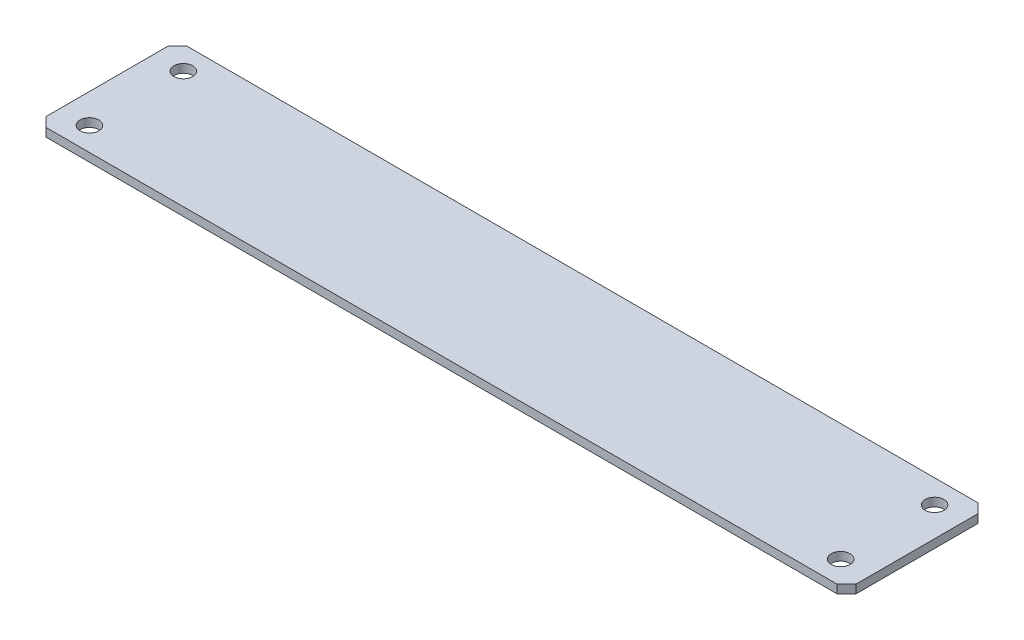
ISO-10303-21;
HEADER;
FILE_DESCRIPTION(('STEP AP214'),'2;1');
FILE_NAME('part.step','',(''),(''),'','','');
FILE_SCHEMA(('AUTOMOTIVE_DESIGN { 1 0 10303 214 1 1 1 1 }'));
ENDSEC;
DATA;
#1=APPLICATION_CONTEXT('core data for automotive mechanical design processes');
#2=APPLICATION_PROTOCOL_DEFINITION('international standard','automotive_design',2000,#1);
#3=PRODUCT_CONTEXT('',#1,'mechanical');
#4=PRODUCT('Part','Part','',(#3));
#5=PRODUCT_RELATED_PRODUCT_CATEGORY('part','',(#4));
#6=PRODUCT_DEFINITION_FORMATION('','',#4);
#7=PRODUCT_DEFINITION_CONTEXT('part definition',#1,'design');
#8=PRODUCT_DEFINITION('design','',#6,#7);
#9=PRODUCT_DEFINITION_SHAPE('','',#8);
#10=(LENGTH_UNIT() NAMED_UNIT(*) SI_UNIT(.MILLI.,.METRE.));
#11=(NAMED_UNIT(*) PLANE_ANGLE_UNIT() SI_UNIT($,.RADIAN.));
#12=(NAMED_UNIT(*) SI_UNIT($,.STERADIAN.) SOLID_ANGLE_UNIT());
#13=UNCERTAINTY_MEASURE_WITH_UNIT(LENGTH_MEASURE(1.E-05),#10,'distance_accuracy_value','');
#14=(GEOMETRIC_REPRESENTATION_CONTEXT(3) GLOBAL_UNCERTAINTY_ASSIGNED_CONTEXT((#13)) GLOBAL_UNIT_ASSIGNED_CONTEXT((#10,
#11,#12)) REPRESENTATION_CONTEXT('',''));
#15=CARTESIAN_POINT('',(0.,0.,0.));
#16=DIRECTION('',(0.,0.,1.));
#17=DIRECTION('',(1.,0.,0.));
#18=AXIS2_PLACEMENT_3D('',#15,#16,#17);
#19=CARTESIAN_POINT('',(0.,0.,0.));
#20=DIRECTION('',(0.,-1.,0.));
#21=DIRECTION('',(0.,0.,-1.));
#22=AXIS2_PLACEMENT_3D('',#19,#20,#21);
#23=PLANE('',#22);
#24=DIRECTION('',(-1.,0.,0.));
#25=VECTOR('',#24,1.);
#26=CARTESIAN_POINT('',(-109.5375,0.,19.05));
#27=LINE('',#26,#25);
#28=CARTESIAN_POINT('',(106.9975,0.,19.05));
#29=VERTEX_POINT('',#28);
#30=CARTESIAN_POINT('',(-106.9975,0.,19.05));
#31=VERTEX_POINT('',#30);
#32=EDGE_CURVE('E294',#29,#31,#27,.T.);
#33=ORIENTED_EDGE('',*,*,#32,.T.);
#34=DIRECTION('',(-0.707106781186548,0.,-0.707106781186548));
#35=VECTOR('',#34,1.);
#36=CARTESIAN_POINT('',(-106.9975,0.,19.05));
#37=LINE('',#36,#35);
#38=CARTESIAN_POINT('',(-109.5375,0.,16.51));
#39=VERTEX_POINT('',#38);
#40=EDGE_CURVE('E302',#31,#39,#37,.T.);
#41=ORIENTED_EDGE('',*,*,#40,.T.);
#42=DIRECTION('',(0.,0.,-1.));
#43=VECTOR('',#42,1.);
#44=CARTESIAN_POINT('',(-109.5375,0.,19.05));
#45=LINE('',#44,#43);
#46=CARTESIAN_POINT('',(-109.5375,0.,-16.51));
#47=VERTEX_POINT('',#46);
#48=EDGE_CURVE('E307',#39,#47,#45,.T.);
#49=ORIENTED_EDGE('',*,*,#48,.T.);
#50=DIRECTION('',(0.707106781186548,0.,-0.707106781186548));
#51=VECTOR('',#50,1.);
#52=CARTESIAN_POINT('',(-109.5375,0.,-16.51));
#53=LINE('',#52,#51);
#54=CARTESIAN_POINT('',(-106.9975,0.,-19.05));
#55=VERTEX_POINT('',#54);
#56=EDGE_CURVE('E312',#47,#55,#53,.T.);
#57=ORIENTED_EDGE('',*,*,#56,.T.);
#58=DIRECTION('',(1.,0.,0.));
#59=VECTOR('',#58,1.);
#60=CARTESIAN_POINT('',(-109.5375,0.,-19.05));
#61=LINE('',#60,#59);
#62=CARTESIAN_POINT('',(106.9975,0.,-19.05));
#63=VERTEX_POINT('',#62);
#64=EDGE_CURVE('E81',#55,#63,#61,.T.);
#65=ORIENTED_EDGE('',*,*,#64,.T.);
#66=DIRECTION('',(0.707106781186548,0.,0.707106781186548));
#67=VECTOR('',#66,1.);
#68=CARTESIAN_POINT('',(106.9975,0.,-19.05));
#69=LINE('',#68,#67);
#70=CARTESIAN_POINT('',(109.5375,0.,-16.51));
#71=VERTEX_POINT('',#70);
#72=EDGE_CURVE('E79',#63,#71,#69,.T.);
#73=ORIENTED_EDGE('',*,*,#72,.T.);
#74=DIRECTION('',(0.,0.,1.));
#75=VECTOR('',#74,1.);
#76=CARTESIAN_POINT('',(109.5375,0.,19.05));
#77=LINE('',#76,#75);
#78=CARTESIAN_POINT('',(109.5375,0.,16.51));
#79=VERTEX_POINT('',#78);
#80=EDGE_CURVE('E76',#71,#79,#77,.T.);
#81=ORIENTED_EDGE('',*,*,#80,.T.);
#82=DIRECTION('',(-0.707106781186548,0.,0.707106781186548));
#83=VECTOR('',#82,1.);
#84=CARTESIAN_POINT('',(109.5375,0.,16.51));
#85=LINE('',#84,#83);
#86=EDGE_CURVE('E288',#79,#29,#85,.T.);
#87=ORIENTED_EDGE('',*,*,#86,.T.);
#88=EDGE_LOOP('',(#33,#41,#49,#57,#65,#73,#81,#87));
#89=FACE_BOUND('',#88,.T.);
#90=CARTESIAN_POINT('',(-101.6,0.,-12.7));
#91=DIRECTION('',(0.,1.,0.));
#92=DIRECTION('',(0.,0.,1.));
#93=AXIS2_PLACEMENT_3D('',#90,#91,#92);
#94=CIRCLE('',#93,2.54);
#95=CARTESIAN_POINT('',(-101.6,0.,-10.16));
#96=VERTEX_POINT('',#95);
#97=EDGE_CURVE('E87',#96,#96,#94,.T.);
#98=ORIENTED_EDGE('',*,*,#97,.T.);
#99=EDGE_LOOP('',(#98));
#100=FACE_BOUND('',#99,.T.);
#101=CARTESIAN_POINT('',(101.6,0.,-12.7));
#102=DIRECTION('',(0.,1.,0.));
#103=DIRECTION('',(0.,0.,1.));
#104=AXIS2_PLACEMENT_3D('',#101,#102,#103);
#105=CIRCLE('',#104,2.54);
#106=CARTESIAN_POINT('',(101.6,0.,-10.16));
#107=VERTEX_POINT('',#106);
#108=EDGE_CURVE('E116',#107,#107,#105,.T.);
#109=ORIENTED_EDGE('',*,*,#108,.T.);
#110=EDGE_LOOP('',(#109));
#111=FACE_BOUND('',#110,.T.);
#112=CARTESIAN_POINT('',(101.6,0.,12.7));
#113=DIRECTION('',(0.,1.,0.));
#114=DIRECTION('',(0.,0.,1.));
#115=AXIS2_PLACEMENT_3D('',#112,#113,#114);
#116=CIRCLE('',#115,2.54);
#117=CARTESIAN_POINT('',(101.6,0.,15.24));
#118=VERTEX_POINT('',#117);
#119=EDGE_CURVE('E118',#118,#118,#116,.T.);
#120=ORIENTED_EDGE('',*,*,#119,.T.);
#121=EDGE_LOOP('',(#120));
#122=FACE_BOUND('',#121,.T.);
#123=CARTESIAN_POINT('',(-101.6,0.,12.7));
#124=DIRECTION('',(0.,1.,0.));
#125=DIRECTION('',(0.,0.,1.));
#126=AXIS2_PLACEMENT_3D('',#123,#124,#125);
#127=CIRCLE('',#126,2.54);
#128=CARTESIAN_POINT('',(-101.6,0.,15.24));
#129=VERTEX_POINT('',#128);
#130=EDGE_CURVE('E17',#129,#129,#127,.T.);
#131=ORIENTED_EDGE('',*,*,#130,.T.);
#132=EDGE_LOOP('',(#131));
#133=FACE_BOUND('',#132,.T.);
#134=ADVANCED_FACE('F14',(#89,#100,#111,#122,#133),#23,.T.);
#135=CARTESIAN_POINT('',(-101.6,0.,12.7));
#136=DIRECTION('',(0.,1.,0.));
#137=DIRECTION('',(0.,0.,1.));
#138=AXIS2_PLACEMENT_3D('',#135,#136,#137);
#139=CYLINDRICAL_SURFACE('',#138,2.54);
#140=ORIENTED_EDGE('',*,*,#130,.F.);
#141=EDGE_LOOP('',(#140));
#142=FACE_BOUND('',#141,.T.);
#143=CARTESIAN_POINT('',(-101.6,2.286,12.7));
#144=DIRECTION('',(0.,1.,0.));
#145=DIRECTION('',(0.,0.,1.));
#146=AXIS2_PLACEMENT_3D('',#143,#144,#145);
#147=CIRCLE('',#146,2.54);
#148=CARTESIAN_POINT('',(-101.6,2.286,15.24));
#149=VERTEX_POINT('',#148);
#150=EDGE_CURVE('E111',#149,#149,#147,.T.);
#151=ORIENTED_EDGE('',*,*,#150,.T.);
#152=EDGE_LOOP('',(#151));
#153=FACE_BOUND('',#152,.T.);
#154=ADVANCED_FACE('F126',(#142,#153),#139,.F.);
#155=CARTESIAN_POINT('',(101.6,0.,12.7));
#156=DIRECTION('',(0.,1.,0.));
#157=DIRECTION('',(0.,0.,1.));
#158=AXIS2_PLACEMENT_3D('',#155,#156,#157);
#159=CYLINDRICAL_SURFACE('',#158,2.54);
#160=ORIENTED_EDGE('',*,*,#119,.F.);
#161=EDGE_LOOP('',(#160));
#162=FACE_BOUND('',#161,.T.);
#163=CARTESIAN_POINT('',(101.6,2.286,12.7));
#164=DIRECTION('',(0.,1.,0.));
#165=DIRECTION('',(0.,0.,1.));
#166=AXIS2_PLACEMENT_3D('',#163,#164,#165);
#167=CIRCLE('',#166,2.54);
#168=CARTESIAN_POINT('',(101.6,2.286,15.24));
#169=VERTEX_POINT('',#168);
#170=EDGE_CURVE('E108',#169,#169,#167,.T.);
#171=ORIENTED_EDGE('',*,*,#170,.T.);
#172=EDGE_LOOP('',(#171));
#173=FACE_BOUND('',#172,.T.);
#174=ADVANCED_FACE('F129',(#162,#173),#159,.F.);
#175=CARTESIAN_POINT('',(101.6,0.,-12.7));
#176=DIRECTION('',(0.,1.,0.));
#177=DIRECTION('',(0.,0.,1.));
#178=AXIS2_PLACEMENT_3D('',#175,#176,#177);
#179=CYLINDRICAL_SURFACE('',#178,2.54);
#180=ORIENTED_EDGE('',*,*,#108,.F.);
#181=EDGE_LOOP('',(#180));
#182=FACE_BOUND('',#181,.T.);
#183=CARTESIAN_POINT('',(101.6,2.286,-12.7));
#184=DIRECTION('',(0.,1.,0.));
#185=DIRECTION('',(0.,0.,1.));
#186=AXIS2_PLACEMENT_3D('',#183,#184,#185);
#187=CIRCLE('',#186,2.54);
#188=CARTESIAN_POINT('',(101.6,2.286,-10.16));
#189=VERTEX_POINT('',#188);
#190=EDGE_CURVE('E105',#189,#189,#187,.T.);
#191=ORIENTED_EDGE('',*,*,#190,.T.);
#192=EDGE_LOOP('',(#191));
#193=FACE_BOUND('',#192,.T.);
#194=ADVANCED_FACE('F172',(#182,#193),#179,.F.);
#195=CARTESIAN_POINT('',(-101.6,0.,-12.7));
#196=DIRECTION('',(0.,1.,0.));
#197=DIRECTION('',(0.,0.,1.));
#198=AXIS2_PLACEMENT_3D('',#195,#196,#197);
#199=CYLINDRICAL_SURFACE('',#198,2.54);
#200=ORIENTED_EDGE('',*,*,#97,.F.);
#201=EDGE_LOOP('',(#200));
#202=FACE_BOUND('',#201,.T.);
#203=CARTESIAN_POINT('',(-101.6,2.286,-12.7));
#204=DIRECTION('',(0.,1.,0.));
#205=DIRECTION('',(0.,0.,1.));
#206=AXIS2_PLACEMENT_3D('',#203,#204,#205);
#207=CIRCLE('',#206,2.54);
#208=CARTESIAN_POINT('',(-101.6,2.286,-10.16));
#209=VERTEX_POINT('',#208);
#210=EDGE_CURVE('E102',#209,#209,#207,.T.);
#211=ORIENTED_EDGE('',*,*,#210,.T.);
#212=EDGE_LOOP('',(#211));
#213=FACE_BOUND('',#212,.T.);
#214=ADVANCED_FACE('F169',(#202,#213),#199,.F.);
#215=CARTESIAN_POINT('',(106.9975,2.286,-19.05));
#216=DIRECTION('',(-0.707106781186548,0.,0.707106781186548));
#217=DIRECTION('',(0.707106781186548,0.,0.707106781186548));
#218=AXIS2_PLACEMENT_3D('',#215,#216,#217);
#219=PLANE('',#218);
#220=DIRECTION('',(0.,1.,0.));
#221=VECTOR('',#220,1.);
#222=CARTESIAN_POINT('',(109.5375,2.286,-16.51));
#223=LINE('',#222,#221);
#224=CARTESIAN_POINT('',(109.5375,2.286,-16.51));
#225=VERTEX_POINT('',#224);
#226=EDGE_CURVE('E86',#225,#71,#223,.F.);
#227=ORIENTED_EDGE('',*,*,#226,.T.);
#228=ORIENTED_EDGE('',*,*,#72,.F.);
#229=DIRECTION('',(0.,1.,0.));
#230=VECTOR('',#229,1.);
#231=CARTESIAN_POINT('',(106.9975,2.286,-19.05));
#232=LINE('',#231,#230);
#233=CARTESIAN_POINT('',(106.9975,2.286,-19.05));
#234=VERTEX_POINT('',#233);
#235=EDGE_CURVE('E314',#63,#234,#232,.T.);
#236=ORIENTED_EDGE('',*,*,#235,.T.);
#237=DIRECTION('',(0.707106781186553,0.,0.707106781186542));
#238=VECTOR('',#237,1.);
#239=CARTESIAN_POINT('',(106.9975,2.286,-19.05));
#240=LINE('',#239,#238);
#241=EDGE_CURVE('E98',#234,#225,#240,.T.);
#242=ORIENTED_EDGE('',*,*,#241,.T.);
#243=EDGE_LOOP('',(#227,#228,#236,#242));
#244=FACE_BOUND('',#243,.T.);
#245=ADVANCED_FACE('F97',(#244),#219,.F.);
#246=CARTESIAN_POINT('',(109.5375,2.286,19.05));
#247=DIRECTION('',(-1.,0.,0.));
#248=DIRECTION('',(0.,0.,1.));
#249=AXIS2_PLACEMENT_3D('',#246,#247,#248);
#250=PLANE('',#249);
#251=DIRECTION('',(0.,1.,0.));
#252=VECTOR('',#251,1.);
#253=CARTESIAN_POINT('',(109.5375,2.286,16.51));
#254=LINE('',#253,#252);
#255=CARTESIAN_POINT('',(109.5375,2.286,16.51));
#256=VERTEX_POINT('',#255);
#257=EDGE_CURVE('E94',#256,#79,#254,.F.);
#258=ORIENTED_EDGE('',*,*,#257,.T.);
#259=ORIENTED_EDGE('',*,*,#80,.F.);
#260=ORIENTED_EDGE('',*,*,#226,.F.);
#261=DIRECTION('',(0.,0.,-1.));
#262=VECTOR('',#261,1.);
#263=CARTESIAN_POINT('',(109.5375,2.286,0.));
#264=LINE('',#263,#262);
#265=EDGE_CURVE('E319',#225,#256,#264,.F.);
#266=ORIENTED_EDGE('',*,*,#265,.T.);
#267=EDGE_LOOP('',(#258,#259,#260,#266));
#268=FACE_BOUND('',#267,.T.);
#269=ADVANCED_FACE('F91',(#268),#250,.F.);
#270=CARTESIAN_POINT('',(109.5375,2.286,16.51));
#271=DIRECTION('',(-0.707106781186548,0.,-0.707106781186548));
#272=DIRECTION('',(-0.707106781186548,0.,0.707106781186548));
#273=AXIS2_PLACEMENT_3D('',#270,#271,#272);
#274=PLANE('',#273);
#275=DIRECTION('',(0.,1.,0.));
#276=VECTOR('',#275,1.);
#277=CARTESIAN_POINT('',(106.9975,2.286,19.05));
#278=LINE('',#277,#276);
#279=CARTESIAN_POINT('',(106.9975,2.286,19.05));
#280=VERTEX_POINT('',#279);
#281=EDGE_CURVE('E287',#280,#29,#278,.F.);
#282=ORIENTED_EDGE('',*,*,#281,.T.);
#283=ORIENTED_EDGE('',*,*,#86,.F.);
#284=ORIENTED_EDGE('',*,*,#257,.F.);
#285=DIRECTION('',(-0.707106781186553,0.,0.707106781186542));
#286=VECTOR('',#285,1.);
#287=CARTESIAN_POINT('',(109.5375,2.286,16.51));
#288=LINE('',#287,#286);
#289=EDGE_CURVE('E290',#256,#280,#288,.T.);
#290=ORIENTED_EDGE('',*,*,#289,.T.);
#291=EDGE_LOOP('',(#282,#283,#284,#290));
#292=FACE_BOUND('',#291,.T.);
#293=ADVANCED_FACE('F160',(#292),#274,.F.);
#294=CARTESIAN_POINT('',(-109.5375,2.286,19.05));
#295=DIRECTION('',(0.,0.,-1.));
#296=DIRECTION('',(-1.,0.,0.));
#297=AXIS2_PLACEMENT_3D('',#294,#295,#296);
#298=PLANE('',#297);
#299=DIRECTION('',(0.,1.,0.));
#300=VECTOR('',#299,1.);
#301=CARTESIAN_POINT('',(-106.9975,2.286,19.05));
#302=LINE('',#301,#300);
#303=CARTESIAN_POINT('',(-106.9975,2.286,19.05));
#304=VERTEX_POINT('',#303);
#305=EDGE_CURVE('E296',#304,#31,#302,.F.);
#306=ORIENTED_EDGE('',*,*,#305,.T.);
#307=ORIENTED_EDGE('',*,*,#32,.F.);
#308=ORIENTED_EDGE('',*,*,#281,.F.);
#309=DIRECTION('',(1.,0.,0.));
#310=VECTOR('',#309,1.);
#311=CARTESIAN_POINT('',(0.,2.286,19.05));
#312=LINE('',#311,#310);
#313=EDGE_CURVE('E322',#280,#304,#312,.F.);
#314=ORIENTED_EDGE('',*,*,#313,.T.);
#315=EDGE_LOOP('',(#306,#307,#308,#314));
#316=FACE_BOUND('',#315,.T.);
#317=ADVANCED_FACE('F156',(#316),#298,.F.);
#318=CARTESIAN_POINT('',(-106.9975,2.286,19.05));
#319=DIRECTION('',(0.707106781186548,0.,-0.707106781186548));
#320=DIRECTION('',(-0.707106781186548,0.,-0.707106781186548));
#321=AXIS2_PLACEMENT_3D('',#318,#319,#320);
#322=PLANE('',#321);
#323=DIRECTION('',(0.,1.,0.));
#324=VECTOR('',#323,1.);
#325=CARTESIAN_POINT('',(-109.5375,2.286,16.51));
#326=LINE('',#325,#324);
#327=CARTESIAN_POINT('',(-109.5375,2.286,16.51));
#328=VERTEX_POINT('',#327);
#329=EDGE_CURVE('E304',#328,#39,#326,.F.);
#330=ORIENTED_EDGE('',*,*,#329,.T.);
#331=ORIENTED_EDGE('',*,*,#40,.F.);
#332=ORIENTED_EDGE('',*,*,#305,.F.);
#333=DIRECTION('',(-0.707106781186547,0.,-0.707106781186547));
#334=VECTOR('',#333,1.);
#335=CARTESIAN_POINT('',(-106.9975,2.286,19.05));
#336=LINE('',#335,#334);
#337=EDGE_CURVE('E324',#304,#328,#336,.T.);
#338=ORIENTED_EDGE('',*,*,#337,.T.);
#339=EDGE_LOOP('',(#330,#331,#332,#338));
#340=FACE_BOUND('',#339,.T.);
#341=ADVANCED_FACE('F152',(#340),#322,.F.);
#342=CARTESIAN_POINT('',(-109.5375,2.286,19.05));
#343=DIRECTION('',(1.,0.,0.));
#344=DIRECTION('',(0.,0.,-1.));
#345=AXIS2_PLACEMENT_3D('',#342,#343,#344);
#346=PLANE('',#345);
#347=DIRECTION('',(0.,1.,0.));
#348=VECTOR('',#347,1.);
#349=CARTESIAN_POINT('',(-109.5375,2.286,-16.51));
#350=LINE('',#349,#348);
#351=CARTESIAN_POINT('',(-109.5375,2.286,-16.51));
#352=VERTEX_POINT('',#351);
#353=EDGE_CURVE('E309',#352,#47,#350,.F.);
#354=ORIENTED_EDGE('',*,*,#353,.T.);
#355=ORIENTED_EDGE('',*,*,#48,.F.);
#356=ORIENTED_EDGE('',*,*,#329,.F.);
#357=DIRECTION('',(0.,0.,-1.));
#358=VECTOR('',#357,1.);
#359=CARTESIAN_POINT('',(-109.5375,2.286,0.));
#360=LINE('',#359,#358);
#361=EDGE_CURVE('E327',#328,#352,#360,.T.);
#362=ORIENTED_EDGE('',*,*,#361,.T.);
#363=EDGE_LOOP('',(#354,#355,#356,#362));
#364=FACE_BOUND('',#363,.T.);
#365=ADVANCED_FACE('F148',(#364),#346,.F.);
#366=CARTESIAN_POINT('',(-109.5375,2.286,-16.51));
#367=DIRECTION('',(0.707106781186548,0.,0.707106781186548));
#368=DIRECTION('',(0.707106781186548,0.,-0.707106781186548));
#369=AXIS2_PLACEMENT_3D('',#366,#367,#368);
#370=PLANE('',#369);
#371=DIRECTION('',(0.,1.,0.));
#372=VECTOR('',#371,1.);
#373=CARTESIAN_POINT('',(-106.9975,2.286,-19.05));
#374=LINE('',#373,#372);
#375=CARTESIAN_POINT('',(-106.9975,2.286,-19.05));
#376=VERTEX_POINT('',#375);
#377=EDGE_CURVE('E31',#376,#55,#374,.F.);
#378=ORIENTED_EDGE('',*,*,#377,.T.);
#379=ORIENTED_EDGE('',*,*,#56,.F.);
#380=ORIENTED_EDGE('',*,*,#353,.F.);
#381=DIRECTION('',(0.707106781186546,0.,-0.707106781186549));
#382=VECTOR('',#381,1.);
#383=CARTESIAN_POINT('',(-109.5375,2.286,-16.51));
#384=LINE('',#383,#382);
#385=EDGE_CURVE('E23',#352,#376,#384,.T.);
#386=ORIENTED_EDGE('',*,*,#385,.T.);
#387=EDGE_LOOP('',(#378,#379,#380,#386));
#388=FACE_BOUND('',#387,.T.);
#389=ADVANCED_FACE('F141',(#388),#370,.F.);
#390=CARTESIAN_POINT('',(-109.5375,2.286,-19.05));
#391=DIRECTION('',(0.,0.,1.));
#392=DIRECTION('',(1.,0.,0.));
#393=AXIS2_PLACEMENT_3D('',#390,#391,#392);
#394=PLANE('',#393);
#395=ORIENTED_EDGE('',*,*,#377,.F.);
#396=DIRECTION('',(1.,0.,0.));
#397=VECTOR('',#396,1.);
#398=CARTESIAN_POINT('',(0.,2.286,-19.05));
#399=LINE('',#398,#397);
#400=EDGE_CURVE('E9',#376,#234,#399,.T.);
#401=ORIENTED_EDGE('',*,*,#400,.T.);
#402=ORIENTED_EDGE('',*,*,#235,.F.);
#403=ORIENTED_EDGE('',*,*,#64,.F.);
#404=EDGE_LOOP('',(#395,#401,#402,#403));
#405=FACE_BOUND('',#404,.T.);
#406=ADVANCED_FACE('F134',(#405),#394,.F.);
#407=CARTESIAN_POINT('',(0.,2.286,0.));
#408=DIRECTION('',(0.,-1.,0.));
#409=DIRECTION('',(0.,0.,-1.));
#410=AXIS2_PLACEMENT_3D('',#407,#408,#409);
#411=PLANE('',#410);
#412=ORIENTED_EDGE('',*,*,#385,.F.);
#413=ORIENTED_EDGE('',*,*,#361,.F.);
#414=ORIENTED_EDGE('',*,*,#337,.F.);
#415=ORIENTED_EDGE('',*,*,#313,.F.);
#416=ORIENTED_EDGE('',*,*,#289,.F.);
#417=ORIENTED_EDGE('',*,*,#265,.F.);
#418=ORIENTED_EDGE('',*,*,#241,.F.);
#419=ORIENTED_EDGE('',*,*,#400,.F.);
#420=EDGE_LOOP('',(#412,#413,#414,#415,#416,#417,#418,#419));
#421=FACE_BOUND('',#420,.T.);
#422=ORIENTED_EDGE('',*,*,#210,.F.);
#423=EDGE_LOOP('',(#422));
#424=FACE_BOUND('',#423,.T.);
#425=ORIENTED_EDGE('',*,*,#190,.F.);
#426=EDGE_LOOP('',(#425));
#427=FACE_BOUND('',#426,.T.);
#428=ORIENTED_EDGE('',*,*,#170,.F.);
#429=EDGE_LOOP('',(#428));
#430=FACE_BOUND('',#429,.T.);
#431=ORIENTED_EDGE('',*,*,#150,.F.);
#432=EDGE_LOOP('',(#431));
#433=FACE_BOUND('',#432,.T.);
#434=ADVANCED_FACE('F132',(#421,#424,#427,#430,#433),#411,.F.);
#435=CLOSED_SHELL('',(#134,#154,#174,#194,#214,#245,#269,#293,#317,#341,#365,#389,#406,#434));
#436=MANIFOLD_SOLID_BREP('B1',#435);
#437=ADVANCED_BREP_SHAPE_REPRESENTATION('',(#18,#436),#14);
#438=SHAPE_DEFINITION_REPRESENTATION(#9,#437);
ENDSEC;
END-ISO-10303-21;
